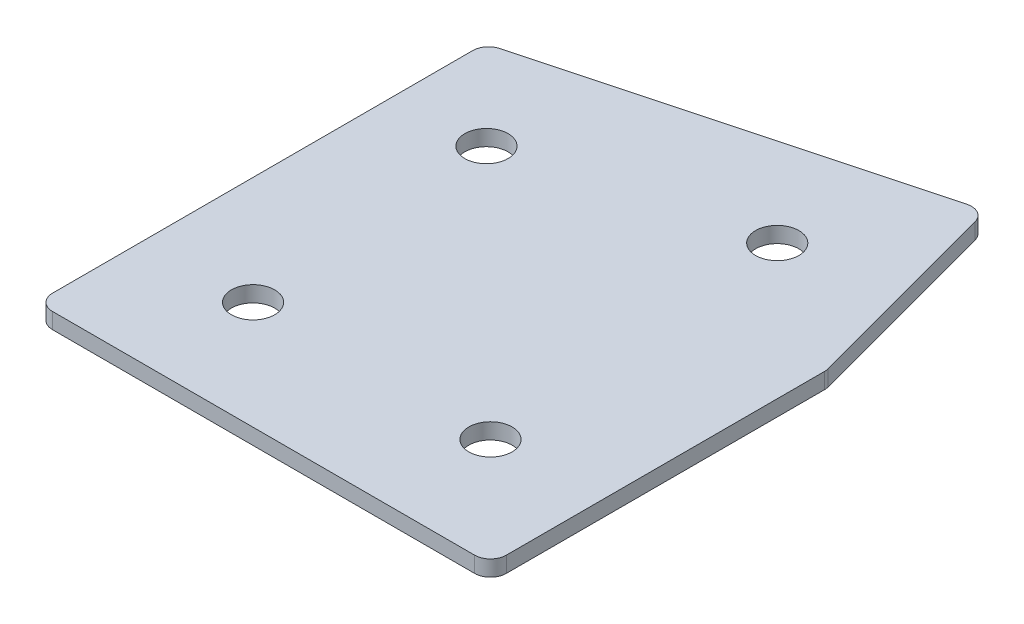
ISO-10303-21;
HEADER;
FILE_DESCRIPTION(('STEP AP214'),'2;1');
FILE_NAME('part.step','',(''),(''),'','','');
FILE_SCHEMA(('AUTOMOTIVE_DESIGN { 1 0 10303 214 1 1 1 1 }'));
ENDSEC;
DATA;
#1=APPLICATION_CONTEXT('core data for automotive mechanical design processes');
#2=APPLICATION_PROTOCOL_DEFINITION('international standard','automotive_design',2000,#1);
#3=PRODUCT_CONTEXT('',#1,'mechanical');
#4=PRODUCT('Part','Part','',(#3));
#5=PRODUCT_RELATED_PRODUCT_CATEGORY('part','',(#4));
#6=PRODUCT_DEFINITION_FORMATION('','',#4);
#7=PRODUCT_DEFINITION_CONTEXT('part definition',#1,'design');
#8=PRODUCT_DEFINITION('design','',#6,#7);
#9=PRODUCT_DEFINITION_SHAPE('','',#8);
#10=(LENGTH_UNIT() NAMED_UNIT(*) SI_UNIT(.MILLI.,.METRE.));
#11=(NAMED_UNIT(*) PLANE_ANGLE_UNIT() SI_UNIT($,.RADIAN.));
#12=(NAMED_UNIT(*) SI_UNIT($,.STERADIAN.) SOLID_ANGLE_UNIT());
#13=UNCERTAINTY_MEASURE_WITH_UNIT(LENGTH_MEASURE(1.E-05),#10,'distance_accuracy_value','');
#14=(GEOMETRIC_REPRESENTATION_CONTEXT(3) GLOBAL_UNCERTAINTY_ASSIGNED_CONTEXT((#13)) GLOBAL_UNIT_ASSIGNED_CONTEXT((#10,
#11,#12)) REPRESENTATION_CONTEXT('',''));
#15=CARTESIAN_POINT('',(0.,0.,0.));
#16=DIRECTION('',(0.,0.,1.));
#17=DIRECTION('',(1.,0.,0.));
#18=AXIS2_PLACEMENT_3D('',#15,#16,#17);
#19=CARTESIAN_POINT('',(0.,0.,0.));
#20=DIRECTION('',(0.,1.,0.));
#21=DIRECTION('',(0.,0.,1.));
#22=AXIS2_PLACEMENT_3D('',#19,#20,#21);
#23=PLANE('',#22);
#24=CARTESIAN_POINT('',(226.757610506707,0.,0.));
#25=DIRECTION('',(0.,1.,0.));
#26=DIRECTION('',(0.,0.,1.));
#27=AXIS2_PLACEMENT_3D('',#24,#25,#26);
#28=CIRCLE('',#27,4.09999999999999);
#29=CARTESIAN_POINT('',(226.757610506707,0.,4.09999999999999));
#30=VERTEX_POINT('',#29);
#31=EDGE_CURVE('E201',#30,#30,#28,.T.);
#32=ORIENTED_EDGE('',*,*,#31,.T.);
#33=EDGE_LOOP('',(#32));
#34=FACE_BOUND('',#33,.T.);
#35=CARTESIAN_POINT('',(221.700850900396,0.,-59.404563960053));
#36=DIRECTION('',(0.,1.,0.));
#37=DIRECTION('',(0.,0.,1.));
#38=AXIS2_PLACEMENT_3D('',#35,#36,#37);
#39=CIRCLE('',#38,4.09999999999999);
#40=CARTESIAN_POINT('',(221.700850900396,0.,-55.304563960053));
#41=VERTEX_POINT('',#40);
#42=EDGE_CURVE('E195',#41,#41,#39,.T.);
#43=ORIENTED_EDGE('',*,*,#42,.T.);
#44=EDGE_LOOP('',(#43));
#45=FACE_BOUND('',#44,.T.);
#46=CARTESIAN_POINT('',(178.234188717388,0.,-47.7577069304395));
#47=DIRECTION('',(0.,1.,0.));
#48=DIRECTION('',(0.,0.,1.));
#49=AXIS2_PLACEMENT_3D('',#46,#47,#48);
#50=CIRCLE('',#49,4.09999999999999);
#51=CARTESIAN_POINT('',(178.234188717388,0.,-43.6577069304395));
#52=VERTEX_POINT('',#51);
#53=EDGE_CURVE('E189',#52,#52,#50,.T.);
#54=ORIENTED_EDGE('',*,*,#53,.T.);
#55=EDGE_LOOP('',(#54));
#56=FACE_BOUND('',#55,.T.);
#57=CARTESIAN_POINT('',(181.757610506707,0.,0.));
#58=DIRECTION('',(0.,1.,0.));
#59=DIRECTION('',(0.,0.,1.));
#60=AXIS2_PLACEMENT_3D('',#57,#58,#59);
#61=CIRCLE('',#60,4.09999999999999);
#62=CARTESIAN_POINT('',(181.757610506707,0.,4.09999999999997));
#63=VERTEX_POINT('',#62);
#64=EDGE_CURVE('E115',#63,#63,#61,.T.);
#65=ORIENTED_EDGE('',*,*,#64,.T.);
#66=EDGE_LOOP('',(#65));
#67=FACE_BOUND('',#66,.T.);
#68=DIRECTION('',(0.,0.,1.));
#69=VECTOR('',#68,1.);
#70=CARTESIAN_POINT('',(161.257610506707,0.,-64.4320082070504));
#71=LINE('',#70,#69);
#72=CARTESIAN_POINT('',(161.257610506707,0.,-62.1300272431135));
#73=VERTEX_POINT('',#72);
#74=CARTESIAN_POINT('',(161.257610506707,0.,17.5000000000001));
#75=VERTEX_POINT('',#74);
#76=EDGE_CURVE('E182',#73,#75,#71,.T.);
#77=ORIENTED_EDGE('',*,*,#76,.F.);
#78=CARTESIAN_POINT('',(164.257610506707,0.,-62.1300272431135));
#79=DIRECTION('',(0.,1.,0.));
#80=DIRECTION('',(0.,0.,1.));
#81=AXIS2_PLACEMENT_3D('',#78,#79,#80);
#82=CIRCLE('',#81,3.);
#83=CARTESIAN_POINT('',(163.481153371399,0.,-65.0278047219807));
#84=VERTEX_POINT('',#83);
#85=EDGE_CURVE('E146',#73,#84,#82,.F.);
#86=ORIENTED_EDGE('',*,*,#85,.T.);
#87=DIRECTION('',(-0.965925826289068,0.,0.258819045102521));
#88=VECTOR('',#87,1.);
#89=CARTESIAN_POINT('',(236.19653991472,0.,-84.5118338235805));
#90=LINE('',#89,#88);
#91=CARTESIAN_POINT('',(233.298762435853,0.,-83.7353766882729));
#92=VERTEX_POINT('',#91);
#93=EDGE_CURVE('E174',#92,#84,#90,.T.);
#94=ORIENTED_EDGE('',*,*,#93,.F.);
#95=CARTESIAN_POINT('',(234.07521957116,0.,-80.8375992094058));
#96=DIRECTION('',(0.,1.,0.));
#97=DIRECTION('',(0.,0.,1.));
#98=AXIS2_PLACEMENT_3D('',#95,#96,#97);
#99=CIRCLE('',#98,3.);
#100=CARTESIAN_POINT('',(236.972997050028,0.,-81.6140563447133));
#101=VERTEX_POINT('',#100);
#102=EDGE_CURVE('E118',#92,#101,#99,.F.);
#103=ORIENTED_EDGE('',*,*,#102,.T.);
#104=DIRECTION('',(-0.258819045102523,0.,-0.965925826289068));
#105=VECTOR('',#104,1.);
#106=CARTESIAN_POINT('',(247.257610506707,0.,-43.2313563881807));
#107=LINE('',#106,#105);
#108=CARTESIAN_POINT('',(247.155387985574,0.,-43.6128560307261));
#109=VERTEX_POINT('',#108);
#110=EDGE_CURVE('E119',#109,#101,#107,.T.);
#111=ORIENTED_EDGE('',*,*,#110,.F.);
#112=CARTESIAN_POINT('',(244.257610506707,0.,-42.8363988954185));
#113=DIRECTION('',(0.,1.,0.));
#114=DIRECTION('',(0.,0.,1.));
#115=AXIS2_PLACEMENT_3D('',#112,#113,#114);
#116=CIRCLE('',#115,3.);
#117=CARTESIAN_POINT('',(247.257610506707,0.,-42.8363988954185));
#118=VERTEX_POINT('',#117);
#119=EDGE_CURVE('E141',#109,#118,#116,.F.);
#120=ORIENTED_EDGE('',*,*,#119,.T.);
#121=DIRECTION('',(0.,0.,-1.));
#122=VECTOR('',#121,1.);
#123=CARTESIAN_POINT('',(247.257610506707,0.,20.5000000000001));
#124=LINE('',#123,#122);
#125=CARTESIAN_POINT('',(247.257610506707,0.,17.5000000000001));
#126=VERTEX_POINT('',#125);
#127=EDGE_CURVE('E123',#126,#118,#124,.T.);
#128=ORIENTED_EDGE('',*,*,#127,.F.);
#129=CARTESIAN_POINT('',(244.257610506707,0.,17.5000000000001));
#130=DIRECTION('',(0.,1.,0.));
#131=DIRECTION('',(0.,0.,1.));
#132=AXIS2_PLACEMENT_3D('',#129,#130,#131);
#133=CIRCLE('',#132,3.);
#134=CARTESIAN_POINT('',(244.257610506707,0.,20.5000000000001));
#135=VERTEX_POINT('',#134);
#136=EDGE_CURVE('E31',#126,#135,#133,.F.);
#137=ORIENTED_EDGE('',*,*,#136,.T.);
#138=DIRECTION('',(1.,0.,0.));
#139=VECTOR('',#138,1.);
#140=CARTESIAN_POINT('',(161.257610506707,0.,20.5000000000001));
#141=LINE('',#140,#139);
#142=CARTESIAN_POINT('',(164.257610506707,0.,20.5000000000001));
#143=VERTEX_POINT('',#142);
#144=EDGE_CURVE('E180',#143,#135,#141,.T.);
#145=ORIENTED_EDGE('',*,*,#144,.F.);
#146=CARTESIAN_POINT('',(164.257610506707,0.,17.5000000000001));
#147=DIRECTION('',(0.,1.,0.));
#148=DIRECTION('',(0.,0.,1.));
#149=AXIS2_PLACEMENT_3D('',#146,#147,#148);
#150=CIRCLE('',#149,3.);
#151=EDGE_CURVE('E144',#143,#75,#150,.F.);
#152=ORIENTED_EDGE('',*,*,#151,.T.);
#153=EDGE_LOOP('',(#77,#86,#94,#103,#111,#120,#128,#137,#145,#152));
#154=FACE_BOUND('',#153,.T.);
#155=ADVANCED_FACE('F16',(#34,#45,#56,#67,#154),#23,.F.);
#156=CARTESIAN_POINT('',(236.19653991472,0.,-84.5118338235805));
#157=DIRECTION('',(-0.258819045102521,0.,-0.965925826289068));
#158=DIRECTION('',(-0.965925826289068,0.,0.258819045102521));
#159=AXIS2_PLACEMENT_3D('',#156,#157,#158);
#160=PLANE('',#159);
#161=ORIENTED_EDGE('',*,*,#93,.T.);
#162=DIRECTION('',(0.,1.,0.));
#163=VECTOR('',#162,1.);
#164=CARTESIAN_POINT('',(163.481153371399,0.,-65.0278047219807));
#165=LINE('',#164,#163);
#166=CARTESIAN_POINT('',(163.481153371399,3.,-65.0278047219807));
#167=VERTEX_POINT('',#166);
#168=EDGE_CURVE('E105',#84,#167,#165,.T.);
#169=ORIENTED_EDGE('',*,*,#168,.T.);
#170=DIRECTION('',(-0.965925826289068,0.,0.258819045102521));
#171=VECTOR('',#170,1.);
#172=CARTESIAN_POINT('',(236.19653991472,3.,-84.5118338235805));
#173=LINE('',#172,#171);
#174=CARTESIAN_POINT('',(233.298762435853,3.,-83.7353766882729));
#175=VERTEX_POINT('',#174);
#176=EDGE_CURVE('E97',#175,#167,#173,.T.);
#177=ORIENTED_EDGE('',*,*,#176,.F.);
#178=DIRECTION('',(0.,1.,0.));
#179=VECTOR('',#178,1.);
#180=CARTESIAN_POINT('',(233.298762435853,0.,-83.7353766882729));
#181=LINE('',#180,#179);
#182=EDGE_CURVE('E111',#175,#92,#181,.F.);
#183=ORIENTED_EDGE('',*,*,#182,.T.);
#184=EDGE_LOOP('',(#161,#169,#177,#183));
#185=FACE_BOUND('',#184,.T.);
#186=ADVANCED_FACE('F110',(#185),#160,.T.);
#187=CARTESIAN_POINT('',(247.257610506707,0.,-43.2313563881807));
#188=DIRECTION('',(0.965925826289068,0.,-0.258819045102523));
#189=DIRECTION('',(-0.258819045102523,0.,-0.965925826289068));
#190=AXIS2_PLACEMENT_3D('',#187,#188,#189);
#191=PLANE('',#190);
#192=DIRECTION('',(-0.258819045102523,0.,-0.965925826289068));
#193=VECTOR('',#192,1.);
#194=CARTESIAN_POINT('',(247.257610506707,3.,-43.2313563881807));
#195=LINE('',#194,#193);
#196=CARTESIAN_POINT('',(247.155387985574,3.,-43.6128560307261));
#197=VERTEX_POINT('',#196);
#198=CARTESIAN_POINT('',(236.972997050028,3.,-81.6140563447133));
#199=VERTEX_POINT('',#198);
#200=EDGE_CURVE('E99',#197,#199,#195,.T.);
#201=ORIENTED_EDGE('',*,*,#200,.F.);
#202=DIRECTION('',(0.,1.,0.));
#203=VECTOR('',#202,1.);
#204=CARTESIAN_POINT('',(247.155387985574,0.,-43.6128560307261));
#205=LINE('',#204,#203);
#206=EDGE_CURVE('E10',#197,#109,#205,.F.);
#207=ORIENTED_EDGE('',*,*,#206,.T.);
#208=ORIENTED_EDGE('',*,*,#110,.T.);
#209=DIRECTION('',(0.,1.,0.));
#210=VECTOR('',#209,1.);
#211=CARTESIAN_POINT('',(236.972997050028,0.,-81.6140563447133));
#212=LINE('',#211,#210);
#213=EDGE_CURVE('E24',#101,#199,#212,.T.);
#214=ORIENTED_EDGE('',*,*,#213,.T.);
#215=EDGE_LOOP('',(#201,#207,#208,#214));
#216=FACE_BOUND('',#215,.T.);
#217=ADVANCED_FACE('F157',(#216),#191,.T.);
#218=CARTESIAN_POINT('',(247.257610506707,0.,20.5000000000001));
#219=DIRECTION('',(1.,0.,0.));
#220=DIRECTION('',(0.,0.,-1.));
#221=AXIS2_PLACEMENT_3D('',#218,#219,#220);
#222=PLANE('',#221);
#223=DIRECTION('',(0.,0.,-1.));
#224=VECTOR('',#223,1.);
#225=CARTESIAN_POINT('',(247.257610506707,3.,20.5000000000001));
#226=LINE('',#225,#224);
#227=CARTESIAN_POINT('',(247.257610506707,3.,17.5000000000001));
#228=VERTEX_POINT('',#227);
#229=CARTESIAN_POINT('',(247.257610506707,3.,-42.8363988954185));
#230=VERTEX_POINT('',#229);
#231=EDGE_CURVE('E170',#228,#230,#226,.T.);
#232=ORIENTED_EDGE('',*,*,#231,.F.);
#233=DIRECTION('',(0.,1.,0.));
#234=VECTOR('',#233,1.);
#235=CARTESIAN_POINT('',(247.257610506707,0.,17.5000000000001));
#236=LINE('',#235,#234);
#237=EDGE_CURVE('E155',#228,#126,#236,.F.);
#238=ORIENTED_EDGE('',*,*,#237,.T.);
#239=ORIENTED_EDGE('',*,*,#127,.T.);
#240=DIRECTION('',(0.,1.,0.));
#241=VECTOR('',#240,1.);
#242=CARTESIAN_POINT('',(247.257610506707,0.,-42.8363988954185));
#243=LINE('',#242,#241);
#244=EDGE_CURVE('E152',#118,#230,#243,.T.);
#245=ORIENTED_EDGE('',*,*,#244,.T.);
#246=EDGE_LOOP('',(#232,#238,#239,#245));
#247=FACE_BOUND('',#246,.T.);
#248=ADVANCED_FACE('F169',(#247),#222,.T.);
#249=CARTESIAN_POINT('',(161.257610506707,0.,20.5000000000001));
#250=DIRECTION('',(0.,0.,1.));
#251=DIRECTION('',(1.,0.,0.));
#252=AXIS2_PLACEMENT_3D('',#249,#250,#251);
#253=PLANE('',#252);
#254=DIRECTION('',(1.,0.,0.));
#255=VECTOR('',#254,1.);
#256=CARTESIAN_POINT('',(161.257610506707,3.,20.5000000000001));
#257=LINE('',#256,#255);
#258=CARTESIAN_POINT('',(164.257610506707,3.,20.5000000000001));
#259=VERTEX_POINT('',#258);
#260=CARTESIAN_POINT('',(244.257610506707,3.,20.5000000000001));
#261=VERTEX_POINT('',#260);
#262=EDGE_CURVE('E173',#259,#261,#257,.T.);
#263=ORIENTED_EDGE('',*,*,#262,.F.);
#264=DIRECTION('',(0.,1.,0.));
#265=VECTOR('',#264,1.);
#266=CARTESIAN_POINT('',(164.257610506707,0.,20.5000000000001));
#267=LINE('',#266,#265);
#268=EDGE_CURVE('E38',#259,#143,#267,.F.);
#269=ORIENTED_EDGE('',*,*,#268,.T.);
#270=ORIENTED_EDGE('',*,*,#144,.T.);
#271=DIRECTION('',(0.,1.,0.));
#272=VECTOR('',#271,1.);
#273=CARTESIAN_POINT('',(244.257610506707,0.,20.5000000000001));
#274=LINE('',#273,#272);
#275=EDGE_CURVE('E148',#135,#261,#274,.T.);
#276=ORIENTED_EDGE('',*,*,#275,.T.);
#277=EDGE_LOOP('',(#263,#269,#270,#276));
#278=FACE_BOUND('',#277,.T.);
#279=ADVANCED_FACE('F337',(#278),#253,.T.);
#280=CARTESIAN_POINT('',(161.257610506707,0.,-64.4320082070504));
#281=DIRECTION('',(-1.,0.,0.));
#282=DIRECTION('',(0.,0.,1.));
#283=AXIS2_PLACEMENT_3D('',#280,#281,#282);
#284=PLANE('',#283);
#285=DIRECTION('',(0.,0.,1.));
#286=VECTOR('',#285,1.);
#287=CARTESIAN_POINT('',(161.257610506707,3.,-64.4320082070504));
#288=LINE('',#287,#286);
#289=CARTESIAN_POINT('',(161.257610506707,3.,-62.1300272431135));
#290=VERTEX_POINT('',#289);
#291=CARTESIAN_POINT('',(161.257610506707,3.,17.5000000000001));
#292=VERTEX_POINT('',#291);
#293=EDGE_CURVE('E114',#290,#292,#288,.T.);
#294=ORIENTED_EDGE('',*,*,#293,.F.);
#295=DIRECTION('',(0.,1.,0.));
#296=VECTOR('',#295,1.);
#297=CARTESIAN_POINT('',(161.257610506707,0.,-62.1300272431135));
#298=LINE('',#297,#296);
#299=EDGE_CURVE('E138',#290,#73,#298,.F.);
#300=ORIENTED_EDGE('',*,*,#299,.T.);
#301=ORIENTED_EDGE('',*,*,#76,.T.);
#302=DIRECTION('',(0.,1.,0.));
#303=VECTOR('',#302,1.);
#304=CARTESIAN_POINT('',(161.257610506707,0.,17.5000000000001));
#305=LINE('',#304,#303);
#306=EDGE_CURVE('E135',#75,#292,#305,.T.);
#307=ORIENTED_EDGE('',*,*,#306,.T.);
#308=EDGE_LOOP('',(#294,#300,#301,#307));
#309=FACE_BOUND('',#308,.T.);
#310=ADVANCED_FACE('F223',(#309),#284,.T.);
#311=CARTESIAN_POINT('',(0.,3.,0.));
#312=DIRECTION('',(0.,1.,0.));
#313=DIRECTION('',(0.,0.,1.));
#314=AXIS2_PLACEMENT_3D('',#311,#312,#313);
#315=PLANE('',#314);
#316=CARTESIAN_POINT('',(226.757610506707,3.,0.));
#317=DIRECTION('',(0.,1.,0.));
#318=DIRECTION('',(0.,0.,1.));
#319=AXIS2_PLACEMENT_3D('',#316,#317,#318);
#320=CIRCLE('',#319,4.09999999999999);
#321=CARTESIAN_POINT('',(226.757610506707,3.,4.09999999999999));
#322=VERTEX_POINT('',#321);
#323=EDGE_CURVE('E204',#322,#322,#320,.T.);
#324=ORIENTED_EDGE('',*,*,#323,.F.);
#325=EDGE_LOOP('',(#324));
#326=FACE_BOUND('',#325,.T.);
#327=CARTESIAN_POINT('',(221.700850900396,3.,-59.404563960053));
#328=DIRECTION('',(0.,1.,0.));
#329=DIRECTION('',(0.,0.,1.));
#330=AXIS2_PLACEMENT_3D('',#327,#328,#329);
#331=CIRCLE('',#330,4.09999999999999);
#332=CARTESIAN_POINT('',(221.700850900396,3.,-55.304563960053));
#333=VERTEX_POINT('',#332);
#334=EDGE_CURVE('E198',#333,#333,#331,.T.);
#335=ORIENTED_EDGE('',*,*,#334,.F.);
#336=EDGE_LOOP('',(#335));
#337=FACE_BOUND('',#336,.T.);
#338=CARTESIAN_POINT('',(178.234188717388,3.,-47.7577069304395));
#339=DIRECTION('',(0.,1.,0.));
#340=DIRECTION('',(0.,0.,1.));
#341=AXIS2_PLACEMENT_3D('',#338,#339,#340);
#342=CIRCLE('',#341,4.09999999999999);
#343=CARTESIAN_POINT('',(178.234188717388,3.,-43.6577069304395));
#344=VERTEX_POINT('',#343);
#345=EDGE_CURVE('E192',#344,#344,#342,.T.);
#346=ORIENTED_EDGE('',*,*,#345,.F.);
#347=EDGE_LOOP('',(#346));
#348=FACE_BOUND('',#347,.T.);
#349=CARTESIAN_POINT('',(181.757610506707,3.,0.));
#350=DIRECTION('',(0.,1.,0.));
#351=DIRECTION('',(0.,0.,1.));
#352=AXIS2_PLACEMENT_3D('',#349,#350,#351);
#353=CIRCLE('',#352,4.09999999999999);
#354=CARTESIAN_POINT('',(181.757610506707,3.,4.09999999999997));
#355=VERTEX_POINT('',#354);
#356=EDGE_CURVE('E186',#355,#355,#353,.T.);
#357=ORIENTED_EDGE('',*,*,#356,.F.);
#358=EDGE_LOOP('',(#357));
#359=FACE_BOUND('',#358,.T.);
#360=ORIENTED_EDGE('',*,*,#176,.T.);
#361=CARTESIAN_POINT('',(164.257610506707,3.,-62.1300272431135));
#362=DIRECTION('',(0.,1.,0.));
#363=DIRECTION('',(0.,0.,1.));
#364=AXIS2_PLACEMENT_3D('',#361,#362,#363);
#365=CIRCLE('',#364,3.);
#366=EDGE_CURVE('E133',#167,#290,#365,.T.);
#367=ORIENTED_EDGE('',*,*,#366,.T.);
#368=ORIENTED_EDGE('',*,*,#293,.T.);
#369=CARTESIAN_POINT('',(164.257610506707,3.,17.5000000000001));
#370=DIRECTION('',(0.,1.,0.));
#371=DIRECTION('',(0.,0.,1.));
#372=AXIS2_PLACEMENT_3D('',#369,#370,#371);
#373=CIRCLE('',#372,3.);
#374=EDGE_CURVE('E131',#292,#259,#373,.T.);
#375=ORIENTED_EDGE('',*,*,#374,.T.);
#376=ORIENTED_EDGE('',*,*,#262,.T.);
#377=CARTESIAN_POINT('',(244.257610506707,3.,17.5000000000001));
#378=DIRECTION('',(0.,1.,0.));
#379=DIRECTION('',(0.,0.,1.));
#380=AXIS2_PLACEMENT_3D('',#377,#378,#379);
#381=CIRCLE('',#380,3.);
#382=EDGE_CURVE('E129',#261,#228,#381,.T.);
#383=ORIENTED_EDGE('',*,*,#382,.T.);
#384=ORIENTED_EDGE('',*,*,#231,.T.);
#385=CARTESIAN_POINT('',(244.257610506707,3.,-42.8363988954185));
#386=DIRECTION('',(0.,1.,0.));
#387=DIRECTION('',(0.,0.,1.));
#388=AXIS2_PLACEMENT_3D('',#385,#386,#387);
#389=CIRCLE('',#388,3.);
#390=EDGE_CURVE('E104',#230,#197,#389,.T.);
#391=ORIENTED_EDGE('',*,*,#390,.T.);
#392=ORIENTED_EDGE('',*,*,#200,.T.);
#393=CARTESIAN_POINT('',(234.07521957116,3.,-80.8375992094058));
#394=DIRECTION('',(0.,1.,0.));
#395=DIRECTION('',(0.,0.,1.));
#396=AXIS2_PLACEMENT_3D('',#393,#394,#395);
#397=CIRCLE('',#396,3.);
#398=EDGE_CURVE('E94',#199,#175,#397,.T.);
#399=ORIENTED_EDGE('',*,*,#398,.T.);
#400=EDGE_LOOP('',(#360,#367,#368,#375,#376,#383,#384,#391,#392,#399));
#401=FACE_BOUND('',#400,.T.);
#402=ADVANCED_FACE('F96',(#326,#337,#348,#359,#401),#315,.T.);
#403=CARTESIAN_POINT('',(181.757610506707,0.,0.));
#404=DIRECTION('',(0.,1.,0.));
#405=DIRECTION('',(0.,0.,1.));
#406=AXIS2_PLACEMENT_3D('',#403,#404,#405);
#407=CYLINDRICAL_SURFACE('',#406,4.09999999999999);
#408=ORIENTED_EDGE('',*,*,#64,.F.);
#409=EDGE_LOOP('',(#408));
#410=FACE_BOUND('',#409,.T.);
#411=ORIENTED_EDGE('',*,*,#356,.T.);
#412=EDGE_LOOP('',(#411));
#413=FACE_BOUND('',#412,.T.);
#414=ADVANCED_FACE('F222',(#410,#413),#407,.F.);
#415=CARTESIAN_POINT('',(178.234188717388,0.,-47.7577069304395));
#416=DIRECTION('',(0.,1.,0.));
#417=DIRECTION('',(0.,0.,1.));
#418=AXIS2_PLACEMENT_3D('',#415,#416,#417);
#419=CYLINDRICAL_SURFACE('',#418,4.09999999999999);
#420=ORIENTED_EDGE('',*,*,#53,.F.);
#421=EDGE_LOOP('',(#420));
#422=FACE_BOUND('',#421,.T.);
#423=ORIENTED_EDGE('',*,*,#345,.T.);
#424=EDGE_LOOP('',(#423));
#425=FACE_BOUND('',#424,.T.);
#426=ADVANCED_FACE('F232',(#422,#425),#419,.F.);
#427=CARTESIAN_POINT('',(221.700850900396,0.,-59.404563960053));
#428=DIRECTION('',(0.,1.,0.));
#429=DIRECTION('',(0.,0.,1.));
#430=AXIS2_PLACEMENT_3D('',#427,#428,#429);
#431=CYLINDRICAL_SURFACE('',#430,4.09999999999999);
#432=ORIENTED_EDGE('',*,*,#42,.F.);
#433=EDGE_LOOP('',(#432));
#434=FACE_BOUND('',#433,.T.);
#435=ORIENTED_EDGE('',*,*,#334,.T.);
#436=EDGE_LOOP('',(#435));
#437=FACE_BOUND('',#436,.T.);
#438=ADVANCED_FACE('F216',(#434,#437),#431,.F.);
#439=CARTESIAN_POINT('',(226.757610506707,0.,0.));
#440=DIRECTION('',(0.,1.,0.));
#441=DIRECTION('',(0.,0.,1.));
#442=AXIS2_PLACEMENT_3D('',#439,#440,#441);
#443=CYLINDRICAL_SURFACE('',#442,4.09999999999999);
#444=ORIENTED_EDGE('',*,*,#31,.F.);
#445=EDGE_LOOP('',(#444));
#446=FACE_BOUND('',#445,.T.);
#447=ORIENTED_EDGE('',*,*,#323,.T.);
#448=EDGE_LOOP('',(#447));
#449=FACE_BOUND('',#448,.T.);
#450=ADVANCED_FACE('F212',(#446,#449),#443,.F.);
#451=CARTESIAN_POINT('',(164.257610506707,0.,-62.1300272431135));
#452=DIRECTION('',(0.,1.,0.));
#453=DIRECTION('',(0.,0.,1.));
#454=AXIS2_PLACEMENT_3D('',#451,#452,#453);
#455=CYLINDRICAL_SURFACE('',#454,3.);
#456=ORIENTED_EDGE('',*,*,#85,.F.);
#457=ORIENTED_EDGE('',*,*,#299,.F.);
#458=ORIENTED_EDGE('',*,*,#366,.F.);
#459=ORIENTED_EDGE('',*,*,#168,.F.);
#460=EDGE_LOOP('',(#456,#457,#458,#459));
#461=FACE_BOUND('',#460,.T.);
#462=ADVANCED_FACE('F215',(#461),#455,.T.);
#463=CARTESIAN_POINT('',(164.257610506707,0.,17.5000000000001));
#464=DIRECTION('',(0.,1.,0.));
#465=DIRECTION('',(0.,0.,1.));
#466=AXIS2_PLACEMENT_3D('',#463,#464,#465);
#467=CYLINDRICAL_SURFACE('',#466,3.);
#468=ORIENTED_EDGE('',*,*,#151,.F.);
#469=ORIENTED_EDGE('',*,*,#268,.F.);
#470=ORIENTED_EDGE('',*,*,#374,.F.);
#471=ORIENTED_EDGE('',*,*,#306,.F.);
#472=EDGE_LOOP('',(#468,#469,#470,#471));
#473=FACE_BOUND('',#472,.T.);
#474=ADVANCED_FACE('F252',(#473),#467,.T.);
#475=CARTESIAN_POINT('',(244.257610506707,0.,17.5000000000001));
#476=DIRECTION('',(0.,1.,0.));
#477=DIRECTION('',(0.,0.,1.));
#478=AXIS2_PLACEMENT_3D('',#475,#476,#477);
#479=CYLINDRICAL_SURFACE('',#478,3.);
#480=ORIENTED_EDGE('',*,*,#136,.F.);
#481=ORIENTED_EDGE('',*,*,#237,.F.);
#482=ORIENTED_EDGE('',*,*,#382,.F.);
#483=ORIENTED_EDGE('',*,*,#275,.F.);
#484=EDGE_LOOP('',(#480,#481,#482,#483));
#485=FACE_BOUND('',#484,.T.);
#486=ADVANCED_FACE('F256',(#485),#479,.T.);
#487=CARTESIAN_POINT('',(244.257610506707,0.,-42.8363988954185));
#488=DIRECTION('',(0.,1.,0.));
#489=DIRECTION('',(0.,0.,1.));
#490=AXIS2_PLACEMENT_3D('',#487,#488,#489);
#491=CYLINDRICAL_SURFACE('',#490,3.);
#492=ORIENTED_EDGE('',*,*,#119,.F.);
#493=ORIENTED_EDGE('',*,*,#206,.F.);
#494=ORIENTED_EDGE('',*,*,#390,.F.);
#495=ORIENTED_EDGE('',*,*,#244,.F.);
#496=EDGE_LOOP('',(#492,#493,#494,#495));
#497=FACE_BOUND('',#496,.T.);
#498=ADVANCED_FACE('F165',(#497),#491,.T.);
#499=CARTESIAN_POINT('',(234.07521957116,0.,-80.8375992094058));
#500=DIRECTION('',(0.,1.,0.));
#501=DIRECTION('',(0.,0.,1.));
#502=AXIS2_PLACEMENT_3D('',#499,#500,#501);
#503=CYLINDRICAL_SURFACE('',#502,3.);
#504=ORIENTED_EDGE('',*,*,#102,.F.);
#505=ORIENTED_EDGE('',*,*,#182,.F.);
#506=ORIENTED_EDGE('',*,*,#398,.F.);
#507=ORIENTED_EDGE('',*,*,#213,.F.);
#508=EDGE_LOOP('',(#504,#505,#506,#507));
#509=FACE_BOUND('',#508,.T.);
#510=ADVANCED_FACE('F18',(#509),#503,.T.);
#511=CLOSED_SHELL('',(#155,#186,#217,#248,#279,#310,#402,#414,#426,#438,#450,#462,#474,#486,
#498,#510));
#512=MANIFOLD_SOLID_BREP('B1',#511);
#513=ADVANCED_BREP_SHAPE_REPRESENTATION('',(#18,#512),#14);
#514=SHAPE_DEFINITION_REPRESENTATION(#9,#513);
ENDSEC;
END-ISO-10303-21;
